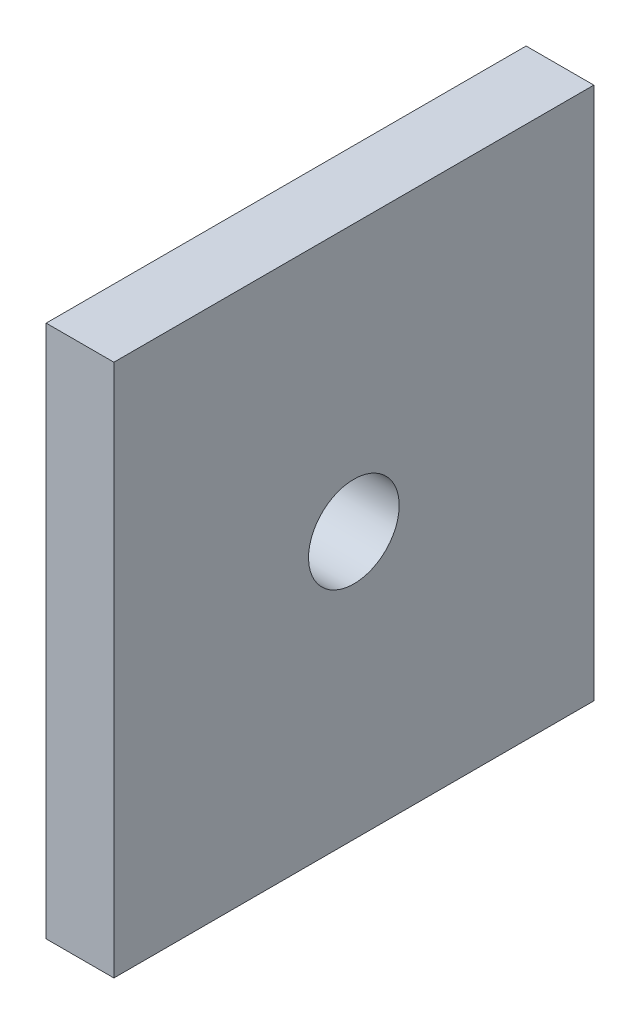
ISO-10303-21;
HEADER;
FILE_DESCRIPTION(('STEP AP214'),'2;1');
FILE_NAME('part.step','',(''),(''),'','','');
FILE_SCHEMA(('AUTOMOTIVE_DESIGN { 1 0 10303 214 1 1 1 1 }'));
ENDSEC;
DATA;
#1=APPLICATION_CONTEXT('core data for automotive mechanical design processes');
#2=APPLICATION_PROTOCOL_DEFINITION('international standard','automotive_design',2000,#1);
#3=PRODUCT_CONTEXT('',#1,'mechanical');
#4=PRODUCT('Part','Part','',(#3));
#5=PRODUCT_RELATED_PRODUCT_CATEGORY('part','',(#4));
#6=PRODUCT_DEFINITION_FORMATION('','',#4);
#7=PRODUCT_DEFINITION_CONTEXT('part definition',#1,'design');
#8=PRODUCT_DEFINITION('design','',#6,#7);
#9=PRODUCT_DEFINITION_SHAPE('','',#8);
#10=(LENGTH_UNIT() NAMED_UNIT(*) SI_UNIT(.MILLI.,.METRE.));
#11=(NAMED_UNIT(*) PLANE_ANGLE_UNIT() SI_UNIT($,.RADIAN.));
#12=(NAMED_UNIT(*) SI_UNIT($,.STERADIAN.) SOLID_ANGLE_UNIT());
#13=UNCERTAINTY_MEASURE_WITH_UNIT(LENGTH_MEASURE(1.E-05),#10,'distance_accuracy_value','');
#14=(GEOMETRIC_REPRESENTATION_CONTEXT(3) GLOBAL_UNCERTAINTY_ASSIGNED_CONTEXT((#13)) GLOBAL_UNIT_ASSIGNED_CONTEXT((#10,
#11,#12)) REPRESENTATION_CONTEXT('',''));
#15=CARTESIAN_POINT('',(0.,0.,0.));
#16=DIRECTION('',(0.,0.,1.));
#17=DIRECTION('',(1.,0.,0.));
#18=AXIS2_PLACEMENT_3D('',#15,#16,#17);
#19=CARTESIAN_POINT('',(0.,0.,45.));
#20=DIRECTION('',(1.,0.,0.));
#21=DIRECTION('',(0.,0.,-1.));
#22=AXIS2_PLACEMENT_3D('',#19,#20,#21);
#23=PLANE('',#22);
#24=CARTESIAN_POINT('',(0.,25.,22.5));
#25=DIRECTION('',(1.,0.,0.));
#26=DIRECTION('',(0.,1.,0.));
#27=AXIS2_PLACEMENT_3D('',#24,#25,#26);
#28=CIRCLE('',#27,4.25);
#29=CARTESIAN_POINT('',(0.,29.25,22.5));
#30=VERTEX_POINT('',#29);
#31=EDGE_CURVE('E103',#30,#30,#28,.T.);
#32=ORIENTED_EDGE('',*,*,#31,.T.);
#33=EDGE_LOOP('',(#32));
#34=FACE_BOUND('',#33,.T.);
#35=DIRECTION('',(0.,-1.,0.));
#36=VECTOR('',#35,1.);
#37=CARTESIAN_POINT('',(0.,0.,0.));
#38=LINE('',#37,#36);
#39=CARTESIAN_POINT('',(0.,50.,0.));
#40=VERTEX_POINT('',#39);
#41=CARTESIAN_POINT('',(0.,0.,0.));
#42=VERTEX_POINT('',#41);
#43=EDGE_CURVE('E100',#40,#42,#38,.T.);
#44=ORIENTED_EDGE('',*,*,#43,.T.);
#45=DIRECTION('',(0.,0.,-1.));
#46=VECTOR('',#45,1.);
#47=CARTESIAN_POINT('',(0.,0.,45.));
#48=LINE('',#47,#46);
#49=CARTESIAN_POINT('',(0.,0.,45.));
#50=VERTEX_POINT('',#49);
#51=EDGE_CURVE('E11',#50,#42,#48,.T.);
#52=ORIENTED_EDGE('',*,*,#51,.F.);
#53=DIRECTION('',(0.,-1.,0.));
#54=VECTOR('',#53,1.);
#55=CARTESIAN_POINT('',(0.,0.,45.));
#56=LINE('',#55,#54);
#57=CARTESIAN_POINT('',(0.,50.,45.));
#58=VERTEX_POINT('',#57);
#59=EDGE_CURVE('E88',#58,#50,#56,.T.);
#60=ORIENTED_EDGE('',*,*,#59,.F.);
#61=DIRECTION('',(0.,0.,-1.));
#62=VECTOR('',#61,1.);
#63=CARTESIAN_POINT('',(0.,50.,45.));
#64=LINE('',#63,#62);
#65=EDGE_CURVE('E96',#58,#40,#64,.T.);
#66=ORIENTED_EDGE('',*,*,#65,.T.);
#67=EDGE_LOOP('',(#44,#52,#60,#66));
#68=FACE_BOUND('',#67,.T.);
#69=ADVANCED_FACE('F37',(#34,#68),#23,.F.);
#70=CARTESIAN_POINT('',(0.,0.,45.));
#71=DIRECTION('',(0.,1.,0.));
#72=DIRECTION('',(0.,0.,1.));
#73=AXIS2_PLACEMENT_3D('',#70,#71,#72);
#74=PLANE('',#73);
#75=DIRECTION('',(1.,0.,0.));
#76=VECTOR('',#75,1.);
#77=CARTESIAN_POINT('',(0.,0.,0.));
#78=LINE('',#77,#76);
#79=CARTESIAN_POINT('',(6.35,0.,0.));
#80=VERTEX_POINT('',#79);
#81=EDGE_CURVE('E92',#42,#80,#78,.T.);
#82=ORIENTED_EDGE('',*,*,#81,.T.);
#83=DIRECTION('',(0.,0.,-1.));
#84=VECTOR('',#83,1.);
#85=CARTESIAN_POINT('',(6.35,0.,45.));
#86=LINE('',#85,#84);
#87=CARTESIAN_POINT('',(6.35,0.,45.));
#88=VERTEX_POINT('',#87);
#89=EDGE_CURVE('E45',#88,#80,#86,.T.);
#90=ORIENTED_EDGE('',*,*,#89,.F.);
#91=DIRECTION('',(1.,0.,0.));
#92=VECTOR('',#91,1.);
#93=CARTESIAN_POINT('',(0.,0.,45.));
#94=LINE('',#93,#92);
#95=EDGE_CURVE('E83',#50,#88,#94,.T.);
#96=ORIENTED_EDGE('',*,*,#95,.F.);
#97=ORIENTED_EDGE('',*,*,#51,.T.);
#98=EDGE_LOOP('',(#82,#90,#96,#97));
#99=FACE_BOUND('',#98,.T.);
#100=ADVANCED_FACE('F91',(#99),#74,.F.);
#101=CARTESIAN_POINT('',(6.35,0.,45.));
#102=DIRECTION('',(-1.,0.,0.));
#103=DIRECTION('',(0.,-1.,0.));
#104=AXIS2_PLACEMENT_3D('',#101,#102,#103);
#105=PLANE('',#104);
#106=CARTESIAN_POINT('',(6.35,25.,22.5));
#107=DIRECTION('',(1.,0.,0.));
#108=DIRECTION('',(0.,1.,0.));
#109=AXIS2_PLACEMENT_3D('',#106,#107,#108);
#110=CIRCLE('',#109,4.25);
#111=CARTESIAN_POINT('',(6.34999999999999,29.25,22.5));
#112=VERTEX_POINT('',#111);
#113=EDGE_CURVE('E114',#112,#112,#110,.T.);
#114=ORIENTED_EDGE('',*,*,#113,.F.);
#115=EDGE_LOOP('',(#114));
#116=FACE_BOUND('',#115,.T.);
#117=DIRECTION('',(0.,1.,0.));
#118=VECTOR('',#117,1.);
#119=CARTESIAN_POINT('',(6.35,0.,0.));
#120=LINE('',#119,#118);
#121=CARTESIAN_POINT('',(6.34999999999999,50.,0.));
#122=VERTEX_POINT('',#121);
#123=EDGE_CURVE('E70',#80,#122,#120,.T.);
#124=ORIENTED_EDGE('',*,*,#123,.T.);
#125=DIRECTION('',(0.,0.,-1.));
#126=VECTOR('',#125,1.);
#127=CARTESIAN_POINT('',(6.34999999999999,50.,45.));
#128=LINE('',#127,#126);
#129=CARTESIAN_POINT('',(6.34999999999999,50.,45.));
#130=VERTEX_POINT('',#129);
#131=EDGE_CURVE('E93',#130,#122,#128,.T.);
#132=ORIENTED_EDGE('',*,*,#131,.F.);
#133=DIRECTION('',(0.,1.,0.));
#134=VECTOR('',#133,1.);
#135=CARTESIAN_POINT('',(6.35,0.,45.));
#136=LINE('',#135,#134);
#137=EDGE_CURVE('E86',#88,#130,#136,.T.);
#138=ORIENTED_EDGE('',*,*,#137,.F.);
#139=ORIENTED_EDGE('',*,*,#89,.T.);
#140=EDGE_LOOP('',(#124,#132,#138,#139));
#141=FACE_BOUND('',#140,.T.);
#142=ADVANCED_FACE('F94',(#116,#141),#105,.F.);
#143=CARTESIAN_POINT('',(0.,50.,45.));
#144=DIRECTION('',(0.,-1.,0.));
#145=DIRECTION('',(0.,0.,-1.));
#146=AXIS2_PLACEMENT_3D('',#143,#144,#145);
#147=PLANE('',#146);
#148=DIRECTION('',(-1.,0.,0.));
#149=VECTOR('',#148,1.);
#150=CARTESIAN_POINT('',(0.,50.,0.));
#151=LINE('',#150,#149);
#152=EDGE_CURVE('E76',#122,#40,#151,.T.);
#153=ORIENTED_EDGE('',*,*,#152,.T.);
#154=ORIENTED_EDGE('',*,*,#65,.F.);
#155=DIRECTION('',(-1.,0.,0.));
#156=VECTOR('',#155,1.);
#157=CARTESIAN_POINT('',(0.,50.,45.));
#158=LINE('',#157,#156);
#159=EDGE_CURVE('E53',#130,#58,#158,.T.);
#160=ORIENTED_EDGE('',*,*,#159,.F.);
#161=ORIENTED_EDGE('',*,*,#131,.T.);
#162=EDGE_LOOP('',(#153,#154,#160,#161));
#163=FACE_BOUND('',#162,.T.);
#164=ADVANCED_FACE('F108',(#163),#147,.F.);
#165=CARTESIAN_POINT('',(0.,0.,45.));
#166=DIRECTION('',(0.,0.,-1.));
#167=DIRECTION('',(-1.,0.,0.));
#168=AXIS2_PLACEMENT_3D('',#165,#166,#167);
#169=PLANE('',#168);
#170=ORIENTED_EDGE('',*,*,#59,.T.);
#171=ORIENTED_EDGE('',*,*,#95,.T.);
#172=ORIENTED_EDGE('',*,*,#137,.T.);
#173=ORIENTED_EDGE('',*,*,#159,.T.);
#174=EDGE_LOOP('',(#170,#171,#172,#173));
#175=FACE_BOUND('',#174,.T.);
#176=ADVANCED_FACE('F84',(#175),#169,.F.);
#177=CARTESIAN_POINT('',(0.,0.,0.));
#178=DIRECTION('',(0.,0.,-1.));
#179=DIRECTION('',(-1.,0.,0.));
#180=AXIS2_PLACEMENT_3D('',#177,#178,#179);
#181=PLANE('',#180);
#182=ORIENTED_EDGE('',*,*,#43,.F.);
#183=ORIENTED_EDGE('',*,*,#152,.F.);
#184=ORIENTED_EDGE('',*,*,#123,.F.);
#185=ORIENTED_EDGE('',*,*,#81,.F.);
#186=EDGE_LOOP('',(#182,#183,#184,#185));
#187=FACE_BOUND('',#186,.T.);
#188=ADVANCED_FACE('F111',(#187),#181,.T.);
#189=CARTESIAN_POINT('',(0.,25.,22.5));
#190=DIRECTION('',(1.,0.,0.));
#191=DIRECTION('',(0.,1.,0.));
#192=AXIS2_PLACEMENT_3D('',#189,#190,#191);
#193=CYLINDRICAL_SURFACE('',#192,4.25);
#194=ORIENTED_EDGE('',*,*,#31,.F.);
#195=EDGE_LOOP('',(#194));
#196=FACE_BOUND('',#195,.T.);
#197=ORIENTED_EDGE('',*,*,#113,.T.);
#198=EDGE_LOOP('',(#197));
#199=FACE_BOUND('',#198,.T.);
#200=ADVANCED_FACE('F121',(#196,#199),#193,.F.);
#201=CLOSED_SHELL('',(#69,#100,#142,#164,#176,#188,#200));
#202=MANIFOLD_SOLID_BREP('B2',#201);
#203=ADVANCED_BREP_SHAPE_REPRESENTATION('',(#18,#202),#14);
#204=SHAPE_DEFINITION_REPRESENTATION(#9,#203);
ENDSEC;
END-ISO-10303-21;
